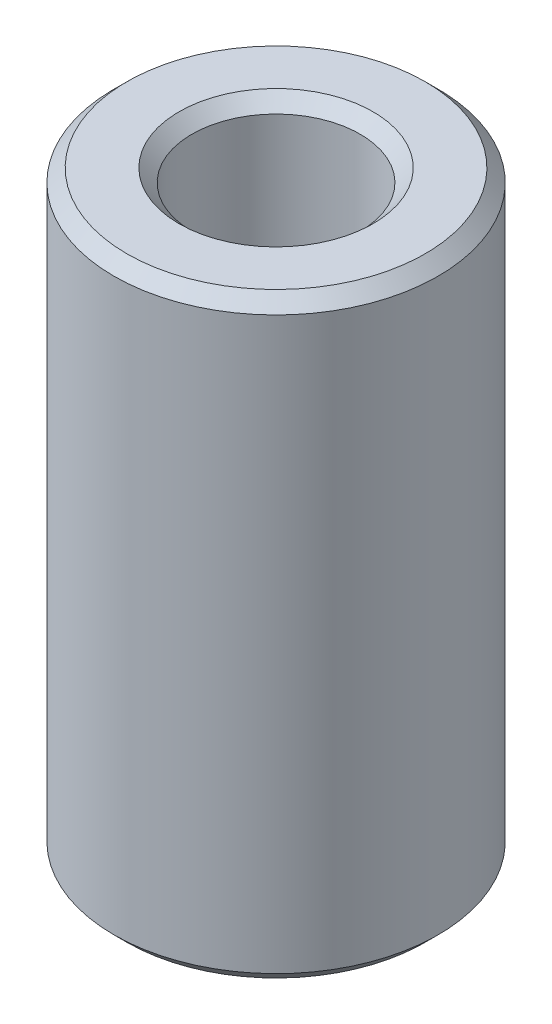
ISO-10303-21;
HEADER;
FILE_DESCRIPTION(('STEP AP214'),'2;1');
FILE_NAME('part.step','',(''),(''),'','','');
FILE_SCHEMA(('AUTOMOTIVE_DESIGN { 1 0 10303 214 1 1 1 1 }'));
ENDSEC;
DATA;
#1=APPLICATION_CONTEXT('core data for automotive mechanical design processes');
#2=APPLICATION_PROTOCOL_DEFINITION('international standard','automotive_design',2000,#1);
#3=PRODUCT_CONTEXT('',#1,'mechanical');
#4=PRODUCT('Part','Part','',(#3));
#5=PRODUCT_RELATED_PRODUCT_CATEGORY('part','',(#4));
#6=PRODUCT_DEFINITION_FORMATION('','',#4);
#7=PRODUCT_DEFINITION_CONTEXT('part definition',#1,'design');
#8=PRODUCT_DEFINITION('design','',#6,#7);
#9=PRODUCT_DEFINITION_SHAPE('','',#8);
#10=(LENGTH_UNIT() NAMED_UNIT(*) SI_UNIT(.MILLI.,.METRE.));
#11=(NAMED_UNIT(*) PLANE_ANGLE_UNIT() SI_UNIT($,.RADIAN.));
#12=(NAMED_UNIT(*) SI_UNIT($,.STERADIAN.) SOLID_ANGLE_UNIT());
#13=UNCERTAINTY_MEASURE_WITH_UNIT(LENGTH_MEASURE(1.E-05),#10,'distance_accuracy_value','');
#14=(GEOMETRIC_REPRESENTATION_CONTEXT(3) GLOBAL_UNCERTAINTY_ASSIGNED_CONTEXT((#13)) GLOBAL_UNIT_ASSIGNED_CONTEXT((#10,
#11,#12)) REPRESENTATION_CONTEXT('',''));
#15=CARTESIAN_POINT('',(0.,0.,0.));
#16=DIRECTION('',(0.,0.,1.));
#17=DIRECTION('',(1.,0.,0.));
#18=AXIS2_PLACEMENT_3D('',#15,#16,#17);
#19=CARTESIAN_POINT('',(0.,183.973604108624,0.));
#20=DIRECTION('',(0.,-1.,0.));
#21=DIRECTION('',(0.,0.,-1.));
#22=AXIS2_PLACEMENT_3D('',#19,#20,#21);
#23=CYLINDRICAL_SURFACE('',#22,50.);
#24=CARTESIAN_POINT('',(0.,3.99024627537253,0.));
#25=DIRECTION('',(0.,1.,0.));
#26=DIRECTION('',(0.,0.,1.));
#27=AXIS2_PLACEMENT_3D('',#24,#25,#26);
#28=CIRCLE('',#27,50.);
#29=CARTESIAN_POINT('',(0.,3.99024627537253,50.));
#30=VERTEX_POINT('',#29);
#31=EDGE_CURVE('E10',#30,#30,#28,.T.);
#32=ORIENTED_EDGE('',*,*,#31,.T.);
#33=EDGE_LOOP('',(#32));
#34=FACE_BOUND('',#33,.T.);
#35=CARTESIAN_POINT('',(0.,179.983357833252,0.));
#36=DIRECTION('',(0.,1.,0.));
#37=DIRECTION('',(0.,0.,1.));
#38=AXIS2_PLACEMENT_3D('',#35,#36,#37);
#39=CIRCLE('',#38,50.);
#40=CARTESIAN_POINT('',(0.,179.983357833252,50.));
#41=VERTEX_POINT('',#40);
#42=EDGE_CURVE('E50',#41,#41,#39,.F.);
#43=ORIENTED_EDGE('',*,*,#42,.T.);
#44=EDGE_LOOP('',(#43));
#45=FACE_BOUND('',#44,.T.);
#46=ADVANCED_FACE('F39',(#34,#45),#23,.T.);
#47=CARTESIAN_POINT('',(0.,183.973604108624,0.));
#48=DIRECTION('',(0.,1.,0.));
#49=DIRECTION('',(0.,0.,1.));
#50=AXIS2_PLACEMENT_3D('',#47,#48,#49);
#51=PLANE('',#50);
#52=CARTESIAN_POINT('',(0.,183.973604108624,0.));
#53=DIRECTION('',(0.,1.,0.));
#54=DIRECTION('',(0.,0.,1.));
#55=AXIS2_PLACEMENT_3D('',#52,#53,#54);
#56=CIRCLE('',#55,29.936196657158);
#57=CARTESIAN_POINT('',(0.,183.973604108624,29.936196657158));
#58=VERTEX_POINT('',#57);
#59=EDGE_CURVE('E58',#58,#58,#56,.F.);
#60=ORIENTED_EDGE('',*,*,#59,.T.);
#61=EDGE_LOOP('',(#60));
#62=FACE_BOUND('',#61,.T.);
#63=CARTESIAN_POINT('',(0.,183.973604108624,0.));
#64=DIRECTION('',(0.,1.,0.));
#65=DIRECTION('',(0.,0.,1.));
#66=AXIS2_PLACEMENT_3D('',#63,#64,#65);
#67=CIRCLE('',#66,46.0097537246275);
#68=CARTESIAN_POINT('',(0.,183.973604108624,46.0097537246275));
#69=VERTEX_POINT('',#68);
#70=EDGE_CURVE('E61',#69,#69,#67,.T.);
#71=ORIENTED_EDGE('',*,*,#70,.T.);
#72=EDGE_LOOP('',(#71));
#73=FACE_BOUND('',#72,.T.);
#74=ADVANCED_FACE('F88',(#62,#73),#51,.T.);
#75=CARTESIAN_POINT('',(0.,0.,0.));
#76=DIRECTION('',(0.,1.,0.));
#77=DIRECTION('',(0.,0.,1.));
#78=AXIS2_PLACEMENT_3D('',#75,#76,#77);
#79=PLANE('',#78);
#80=CARTESIAN_POINT('',(0.,0.,0.));
#81=DIRECTION('',(0.,1.,0.));
#82=DIRECTION('',(0.,0.,1.));
#83=AXIS2_PLACEMENT_3D('',#80,#81,#82);
#84=CIRCLE('',#83,29.9361966571579);
#85=CARTESIAN_POINT('',(0.,0.,29.9361966571579));
#86=VERTEX_POINT('',#85);
#87=EDGE_CURVE('E51',#86,#86,#84,.T.);
#88=ORIENTED_EDGE('',*,*,#87,.T.);
#89=EDGE_LOOP('',(#88));
#90=FACE_BOUND('',#89,.T.);
#91=CARTESIAN_POINT('',(0.,0.,0.));
#92=DIRECTION('',(0.,1.,0.));
#93=DIRECTION('',(0.,0.,1.));
#94=AXIS2_PLACEMENT_3D('',#91,#92,#93);
#95=CIRCLE('',#94,46.0097537246275);
#96=CARTESIAN_POINT('',(0.,0.,46.0097537246275));
#97=VERTEX_POINT('',#96);
#98=EDGE_CURVE('E54',#97,#97,#95,.F.);
#99=ORIENTED_EDGE('',*,*,#98,.T.);
#100=EDGE_LOOP('',(#99));
#101=FACE_BOUND('',#100,.T.);
#102=ADVANCED_FACE('F83',(#90,#101),#79,.F.);
#103=CARTESIAN_POINT('',(0.,183.973604108624,0.));
#104=DIRECTION('',(0.,-1.,0.));
#105=DIRECTION('',(0.,0.,-1.));
#106=AXIS2_PLACEMENT_3D('',#103,#104,#105);
#107=CYLINDRICAL_SURFACE('',#106,25.9459503817854);
#108=CARTESIAN_POINT('',(0.,179.983357833252,0.));
#109=DIRECTION('',(0.,1.,0.));
#110=DIRECTION('',(0.,0.,1.));
#111=AXIS2_PLACEMENT_3D('',#108,#109,#110);
#112=CIRCLE('',#111,25.9459503817854);
#113=CARTESIAN_POINT('',(0.,179.983357833252,25.9459503817854));
#114=VERTEX_POINT('',#113);
#115=EDGE_CURVE('E67',#114,#114,#112,.T.);
#116=ORIENTED_EDGE('',*,*,#115,.T.);
#117=EDGE_LOOP('',(#116));
#118=FACE_BOUND('',#117,.T.);
#119=CARTESIAN_POINT('',(0.,3.99024627537253,0.));
#120=DIRECTION('',(0.,1.,0.));
#121=DIRECTION('',(0.,0.,1.));
#122=AXIS2_PLACEMENT_3D('',#119,#120,#121);
#123=CIRCLE('',#122,25.9459503817854);
#124=CARTESIAN_POINT('',(0.,3.99024627537253,25.9459503817854));
#125=VERTEX_POINT('',#124);
#126=EDGE_CURVE('E69',#125,#125,#123,.F.);
#127=ORIENTED_EDGE('',*,*,#126,.T.);
#128=EDGE_LOOP('',(#127));
#129=FACE_BOUND('',#128,.T.);
#130=ADVANCED_FACE('F71',(#118,#129),#107,.F.);
#131=CARTESIAN_POINT('',(0.,179.983357833252,0.));
#132=DIRECTION('',(0.,1.,0.));
#133=DIRECTION('',(0.,0.,1.));
#134=AXIS2_PLACEMENT_3D('',#131,#132,#133);
#135=CONICAL_SURFACE('',#134,25.9459503817854,0.785398163397454);
#136=ORIENTED_EDGE('',*,*,#59,.F.);
#137=EDGE_LOOP('',(#136));
#138=FACE_BOUND('',#137,.T.);
#139=ORIENTED_EDGE('',*,*,#115,.F.);
#140=EDGE_LOOP('',(#139));
#141=FACE_BOUND('',#140,.T.);
#142=ADVANCED_FACE('F77',(#138,#141),#135,.F.);
#143=CARTESIAN_POINT('',(0.,0.,0.));
#144=DIRECTION('',(0.,-1.,0.));
#145=DIRECTION('',(0.,0.,-1.));
#146=AXIS2_PLACEMENT_3D('',#143,#144,#145);
#147=CONICAL_SURFACE('',#146,29.9361966571579,0.785398163397444);
#148=ORIENTED_EDGE('',*,*,#126,.F.);
#149=EDGE_LOOP('',(#148));
#150=FACE_BOUND('',#149,.T.);
#151=ORIENTED_EDGE('',*,*,#87,.F.);
#152=EDGE_LOOP('',(#151));
#153=FACE_BOUND('',#152,.T.);
#154=ADVANCED_FACE('F73',(#150,#153),#147,.F.);
#155=CARTESIAN_POINT('',(0.,3.99024627537253,0.));
#156=DIRECTION('',(0.,1.,0.));
#157=DIRECTION('',(0.,0.,1.));
#158=AXIS2_PLACEMENT_3D('',#155,#156,#157);
#159=CONICAL_SURFACE('',#158,50.,0.785398163397451);
#160=ORIENTED_EDGE('',*,*,#98,.F.);
#161=EDGE_LOOP('',(#160));
#162=FACE_BOUND('',#161,.T.);
#163=ORIENTED_EDGE('',*,*,#31,.F.);
#164=EDGE_LOOP('',(#163));
#165=FACE_BOUND('',#164,.T.);
#166=ADVANCED_FACE('F76',(#162,#165),#159,.T.);
#167=CARTESIAN_POINT('',(0.,183.973604108624,0.));
#168=DIRECTION('',(0.,-1.,0.));
#169=DIRECTION('',(0.,0.,-1.));
#170=AXIS2_PLACEMENT_3D('',#167,#168,#169);
#171=CONICAL_SURFACE('',#170,46.0097537246275,0.785398163397444);
#172=ORIENTED_EDGE('',*,*,#42,.F.);
#173=EDGE_LOOP('',(#172));
#174=FACE_BOUND('',#173,.T.);
#175=ORIENTED_EDGE('',*,*,#70,.F.);
#176=EDGE_LOOP('',(#175));
#177=FACE_BOUND('',#176,.T.);
#178=ADVANCED_FACE('F45',(#174,#177),#171,.T.);
#179=CLOSED_SHELL('',(#46,#74,#102,#130,#142,#154,#166,#178));
#180=MANIFOLD_SOLID_BREP('B2',#179);
#181=ADVANCED_BREP_SHAPE_REPRESENTATION('',(#18,#180),#14);
#182=SHAPE_DEFINITION_REPRESENTATION(#9,#181);
ENDSEC;
END-ISO-10303-21;
